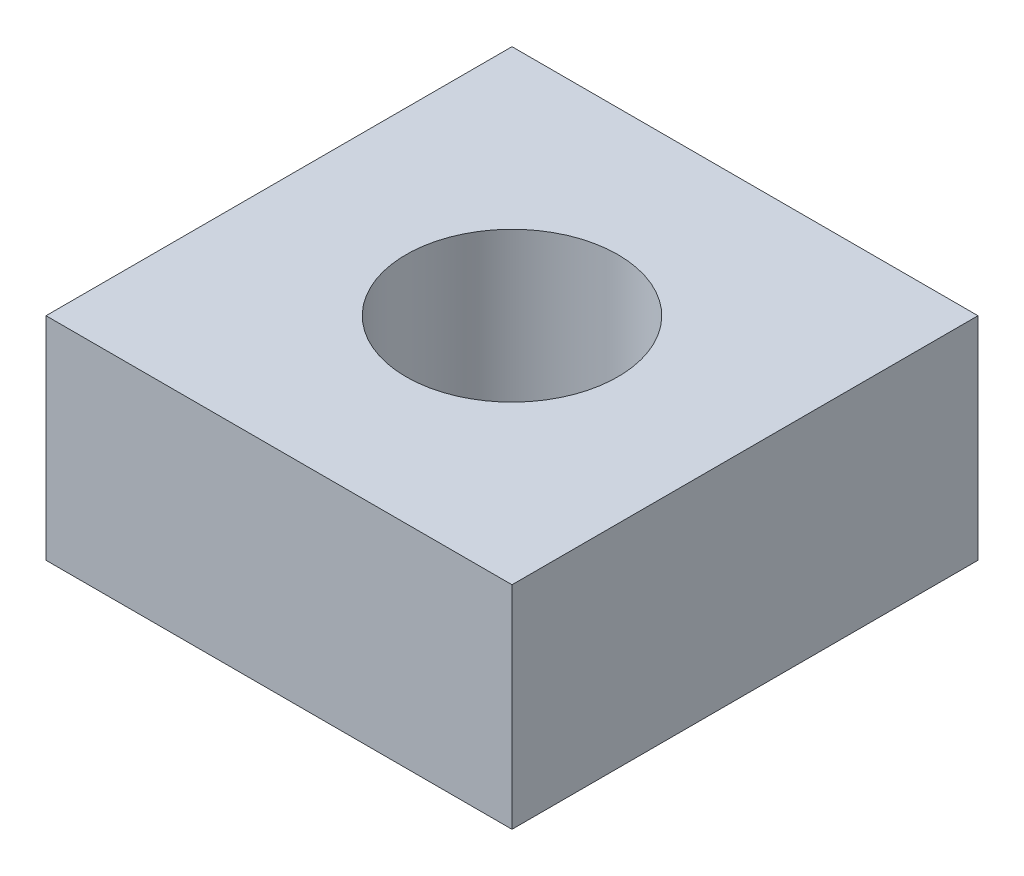
ISO-10303-21;
HEADER;
FILE_DESCRIPTION(('STEP AP214'),'2;1');
FILE_NAME('part.step','',(''),(''),'','','');
FILE_SCHEMA(('AUTOMOTIVE_DESIGN { 1 0 10303 214 1 1 1 1 }'));
ENDSEC;
DATA;
#1=APPLICATION_CONTEXT('core data for automotive mechanical design processes');
#2=APPLICATION_PROTOCOL_DEFINITION('international standard','automotive_design',2000,#1);
#3=PRODUCT_CONTEXT('',#1,'mechanical');
#4=PRODUCT('Part','Part','',(#3));
#5=PRODUCT_RELATED_PRODUCT_CATEGORY('part','',(#4));
#6=PRODUCT_DEFINITION_FORMATION('','',#4);
#7=PRODUCT_DEFINITION_CONTEXT('part definition',#1,'design');
#8=PRODUCT_DEFINITION('design','',#6,#7);
#9=PRODUCT_DEFINITION_SHAPE('','',#8);
#10=(LENGTH_UNIT() NAMED_UNIT(*) SI_UNIT(.MILLI.,.METRE.));
#11=(NAMED_UNIT(*) PLANE_ANGLE_UNIT() SI_UNIT($,.RADIAN.));
#12=(NAMED_UNIT(*) SI_UNIT($,.STERADIAN.) SOLID_ANGLE_UNIT());
#13=UNCERTAINTY_MEASURE_WITH_UNIT(LENGTH_MEASURE(1.E-05),#10,'distance_accuracy_value','');
#14=(GEOMETRIC_REPRESENTATION_CONTEXT(3) GLOBAL_UNCERTAINTY_ASSIGNED_CONTEXT((#13)) GLOBAL_UNIT_ASSIGNED_CONTEXT((#10,
#11,#12)) REPRESENTATION_CONTEXT('',''));
#15=CARTESIAN_POINT('',(0.,0.,0.));
#16=DIRECTION('',(0.,0.,1.));
#17=DIRECTION('',(1.,0.,0.));
#18=AXIS2_PLACEMENT_3D('',#15,#16,#17);
#19=CARTESIAN_POINT('',(2.75,1.25,2.75));
#20=DIRECTION('',(-1.,0.,0.));
#21=DIRECTION('',(0.,0.,1.));
#22=AXIS2_PLACEMENT_3D('',#19,#20,#21);
#23=PLANE('',#22);
#24=DIRECTION('',(0.,0.,-1.));
#25=VECTOR('',#24,1.);
#26=CARTESIAN_POINT('',(2.75,-1.25,2.75));
#27=LINE('',#26,#25);
#28=CARTESIAN_POINT('',(2.75,-1.25,2.75));
#29=VERTEX_POINT('',#28);
#30=CARTESIAN_POINT('',(2.75,-1.25,-2.75));
#31=VERTEX_POINT('',#30);
#32=EDGE_CURVE('E99',#29,#31,#27,.T.);
#33=ORIENTED_EDGE('',*,*,#32,.T.);
#34=DIRECTION('',(0.,-1.,0.));
#35=VECTOR('',#34,1.);
#36=CARTESIAN_POINT('',(2.75,1.25,-2.75));
#37=LINE('',#36,#35);
#38=CARTESIAN_POINT('',(2.75,1.25,-2.75));
#39=VERTEX_POINT('',#38);
#40=EDGE_CURVE('E11',#39,#31,#37,.T.);
#41=ORIENTED_EDGE('',*,*,#40,.F.);
#42=DIRECTION('',(0.,0.,-1.));
#43=VECTOR('',#42,1.);
#44=CARTESIAN_POINT('',(2.75,1.25,2.75));
#45=LINE('',#44,#43);
#46=CARTESIAN_POINT('',(2.75,1.25,2.75));
#47=VERTEX_POINT('',#46);
#48=EDGE_CURVE('E87',#47,#39,#45,.T.);
#49=ORIENTED_EDGE('',*,*,#48,.F.);
#50=DIRECTION('',(0.,-1.,0.));
#51=VECTOR('',#50,1.);
#52=CARTESIAN_POINT('',(2.75,1.25,2.75));
#53=LINE('',#52,#51);
#54=EDGE_CURVE('E95',#47,#29,#53,.T.);
#55=ORIENTED_EDGE('',*,*,#54,.T.);
#56=EDGE_LOOP('',(#33,#41,#49,#55));
#57=FACE_BOUND('',#56,.T.);
#58=ADVANCED_FACE('F36',(#57),#23,.F.);
#59=CARTESIAN_POINT('',(-2.75,1.25,-2.75));
#60=DIRECTION('',(0.,0.,1.));
#61=DIRECTION('',(1.,0.,0.));
#62=AXIS2_PLACEMENT_3D('',#59,#60,#61);
#63=PLANE('',#62);
#64=DIRECTION('',(-1.,0.,0.));
#65=VECTOR('',#64,1.);
#66=CARTESIAN_POINT('',(-2.75,-1.25,-2.75));
#67=LINE('',#66,#65);
#68=CARTESIAN_POINT('',(-2.75,-1.25,-2.75));
#69=VERTEX_POINT('',#68);
#70=EDGE_CURVE('E91',#31,#69,#67,.T.);
#71=ORIENTED_EDGE('',*,*,#70,.T.);
#72=DIRECTION('',(0.,-1.,0.));
#73=VECTOR('',#72,1.);
#74=CARTESIAN_POINT('',(-2.75,1.25,-2.75));
#75=LINE('',#74,#73);
#76=CARTESIAN_POINT('',(-2.75,1.25,-2.75));
#77=VERTEX_POINT('',#76);
#78=EDGE_CURVE('E44',#77,#69,#75,.T.);
#79=ORIENTED_EDGE('',*,*,#78,.F.);
#80=DIRECTION('',(-1.,0.,0.));
#81=VECTOR('',#80,1.);
#82=CARTESIAN_POINT('',(-2.75,1.25,-2.75));
#83=LINE('',#82,#81);
#84=EDGE_CURVE('E82',#39,#77,#83,.T.);
#85=ORIENTED_EDGE('',*,*,#84,.F.);
#86=ORIENTED_EDGE('',*,*,#40,.T.);
#87=EDGE_LOOP('',(#71,#79,#85,#86));
#88=FACE_BOUND('',#87,.T.);
#89=ADVANCED_FACE('F90',(#88),#63,.F.);
#90=CARTESIAN_POINT('',(-2.75,1.25,2.75));
#91=DIRECTION('',(1.,0.,0.));
#92=DIRECTION('',(0.,0.,-1.));
#93=AXIS2_PLACEMENT_3D('',#90,#91,#92);
#94=PLANE('',#93);
#95=DIRECTION('',(0.,0.,1.));
#96=VECTOR('',#95,1.);
#97=CARTESIAN_POINT('',(-2.75,-1.25,2.75));
#98=LINE('',#97,#96);
#99=CARTESIAN_POINT('',(-2.75,-1.25,2.75));
#100=VERTEX_POINT('',#99);
#101=EDGE_CURVE('E69',#69,#100,#98,.T.);
#102=ORIENTED_EDGE('',*,*,#101,.T.);
#103=DIRECTION('',(0.,-1.,0.));
#104=VECTOR('',#103,1.);
#105=CARTESIAN_POINT('',(-2.75,1.25,2.75));
#106=LINE('',#105,#104);
#107=CARTESIAN_POINT('',(-2.75,1.25,2.75));
#108=VERTEX_POINT('',#107);
#109=EDGE_CURVE('E92',#108,#100,#106,.T.);
#110=ORIENTED_EDGE('',*,*,#109,.F.);
#111=DIRECTION('',(0.,0.,1.));
#112=VECTOR('',#111,1.);
#113=CARTESIAN_POINT('',(-2.75,1.25,2.75));
#114=LINE('',#113,#112);
#115=EDGE_CURVE('E85',#77,#108,#114,.T.);
#116=ORIENTED_EDGE('',*,*,#115,.F.);
#117=ORIENTED_EDGE('',*,*,#78,.T.);
#118=EDGE_LOOP('',(#102,#110,#116,#117));
#119=FACE_BOUND('',#118,.T.);
#120=ADVANCED_FACE('F93',(#119),#94,.F.);
#121=CARTESIAN_POINT('',(-2.75,1.25,2.75));
#122=DIRECTION('',(0.,0.,-1.));
#123=DIRECTION('',(-1.,0.,0.));
#124=AXIS2_PLACEMENT_3D('',#121,#122,#123);
#125=PLANE('',#124);
#126=DIRECTION('',(1.,0.,0.));
#127=VECTOR('',#126,1.);
#128=CARTESIAN_POINT('',(-2.75,-1.25,2.75));
#129=LINE('',#128,#127);
#130=EDGE_CURVE('E75',#100,#29,#129,.T.);
#131=ORIENTED_EDGE('',*,*,#130,.T.);
#132=ORIENTED_EDGE('',*,*,#54,.F.);
#133=DIRECTION('',(1.,0.,0.));
#134=VECTOR('',#133,1.);
#135=CARTESIAN_POINT('',(-2.75,1.25,2.75));
#136=LINE('',#135,#134);
#137=EDGE_CURVE('E52',#108,#47,#136,.T.);
#138=ORIENTED_EDGE('',*,*,#137,.F.);
#139=ORIENTED_EDGE('',*,*,#109,.T.);
#140=EDGE_LOOP('',(#131,#132,#138,#139));
#141=FACE_BOUND('',#140,.T.);
#142=ADVANCED_FACE('F107',(#141),#125,.F.);
#143=CARTESIAN_POINT('',(0.,1.25,0.));
#144=DIRECTION('',(0.,-1.,0.));
#145=DIRECTION('',(0.,0.,-1.));
#146=AXIS2_PLACEMENT_3D('',#143,#144,#145);
#147=PLANE('',#146);
#148=CARTESIAN_POINT('',(0.,1.25,0.));
#149=DIRECTION('',(0.,1.,0.));
#150=DIRECTION('',(0.,0.,1.));
#151=AXIS2_PLACEMENT_3D('',#148,#149,#150);
#152=CIRCLE('',#151,1.25);
#153=CARTESIAN_POINT('',(0.,1.25,1.25));
#154=VERTEX_POINT('',#153);
#155=EDGE_CURVE('E115',#154,#154,#152,.T.);
#156=ORIENTED_EDGE('',*,*,#155,.F.);
#157=EDGE_LOOP('',(#156));
#158=FACE_BOUND('',#157,.T.);
#159=ORIENTED_EDGE('',*,*,#48,.T.);
#160=ORIENTED_EDGE('',*,*,#84,.T.);
#161=ORIENTED_EDGE('',*,*,#115,.T.);
#162=ORIENTED_EDGE('',*,*,#137,.T.);
#163=EDGE_LOOP('',(#159,#160,#161,#162));
#164=FACE_BOUND('',#163,.T.);
#165=ADVANCED_FACE('F83',(#158,#164),#147,.F.);
#166=CARTESIAN_POINT('',(0.,-1.25,0.));
#167=DIRECTION('',(0.,-1.,0.));
#168=DIRECTION('',(0.,0.,-1.));
#169=AXIS2_PLACEMENT_3D('',#166,#167,#168);
#170=PLANE('',#169);
#171=CARTESIAN_POINT('',(0.,-1.25,0.));
#172=DIRECTION('',(0.,-1.,0.));
#173=DIRECTION('',(0.,0.,-1.));
#174=AXIS2_PLACEMENT_3D('',#171,#172,#173);
#175=CIRCLE('',#174,1.25);
#176=CARTESIAN_POINT('',(0.,-1.25,-1.25));
#177=VERTEX_POINT('',#176);
#178=EDGE_CURVE('E102',#177,#177,#175,.T.);
#179=ORIENTED_EDGE('',*,*,#178,.F.);
#180=EDGE_LOOP('',(#179));
#181=FACE_BOUND('',#180,.T.);
#182=ORIENTED_EDGE('',*,*,#32,.F.);
#183=ORIENTED_EDGE('',*,*,#130,.F.);
#184=ORIENTED_EDGE('',*,*,#101,.F.);
#185=ORIENTED_EDGE('',*,*,#70,.F.);
#186=EDGE_LOOP('',(#182,#183,#184,#185));
#187=FACE_BOUND('',#186,.T.);
#188=ADVANCED_FACE('F110',(#181,#187),#170,.T.);
#189=CARTESIAN_POINT('',(0.,1.25,0.));
#190=DIRECTION('',(0.,1.,0.));
#191=DIRECTION('',(0.,0.,1.));
#192=AXIS2_PLACEMENT_3D('',#189,#190,#191);
#193=CYLINDRICAL_SURFACE('',#192,1.25);
#194=ORIENTED_EDGE('',*,*,#155,.T.);
#195=EDGE_LOOP('',(#194));
#196=FACE_BOUND('',#195,.T.);
#197=ORIENTED_EDGE('',*,*,#178,.T.);
#198=EDGE_LOOP('',(#197));
#199=FACE_BOUND('',#198,.T.);
#200=ADVANCED_FACE('F119',(#196,#199),#193,.F.);
#201=CLOSED_SHELL('',(#58,#89,#120,#142,#165,#188,#200));
#202=MANIFOLD_SOLID_BREP('B2',#201);
#203=ADVANCED_BREP_SHAPE_REPRESENTATION('',(#18,#202),#14);
#204=SHAPE_DEFINITION_REPRESENTATION(#9,#203);
ENDSEC;
END-ISO-10303-21;
